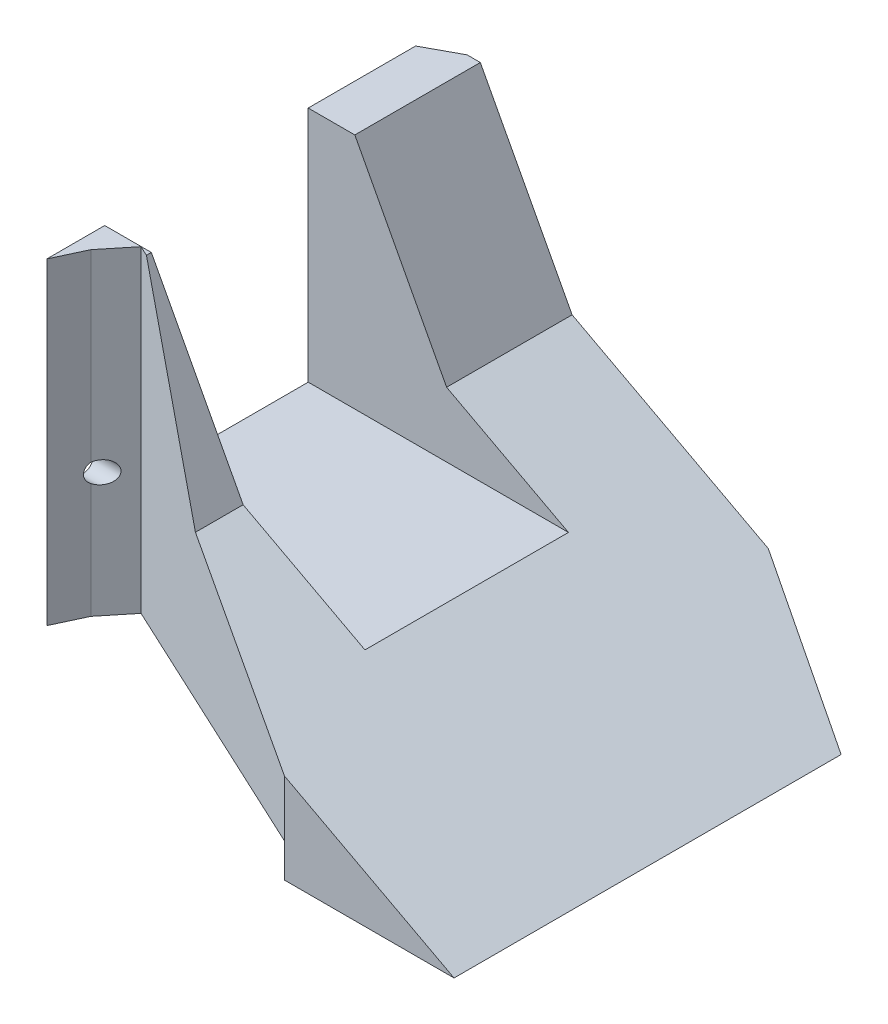
ISO-10303-21;
HEADER;
FILE_DESCRIPTION(('STEP AP214'),'2;1');
FILE_NAME('part.step','',(''),(''),'','','');
FILE_SCHEMA(('AUTOMOTIVE_DESIGN { 1 0 10303 214 1 1 1 1 }'));
ENDSEC;
DATA;
#1=APPLICATION_CONTEXT('core data for automotive mechanical design processes');
#2=APPLICATION_PROTOCOL_DEFINITION('international standard','automotive_design',2000,#1);
#3=PRODUCT_CONTEXT('',#1,'mechanical');
#4=PRODUCT('Part','Part','',(#3));
#5=PRODUCT_RELATED_PRODUCT_CATEGORY('part','',(#4));
#6=PRODUCT_DEFINITION_FORMATION('','',#4);
#7=PRODUCT_DEFINITION_CONTEXT('part definition',#1,'design');
#8=PRODUCT_DEFINITION('design','',#6,#7);
#9=PRODUCT_DEFINITION_SHAPE('','',#8);
#10=(LENGTH_UNIT() NAMED_UNIT(*) SI_UNIT(.MILLI.,.METRE.));
#11=(NAMED_UNIT(*) PLANE_ANGLE_UNIT() SI_UNIT($,.RADIAN.));
#12=(NAMED_UNIT(*) SI_UNIT($,.STERADIAN.) SOLID_ANGLE_UNIT());
#13=UNCERTAINTY_MEASURE_WITH_UNIT(LENGTH_MEASURE(1.E-05),#10,'distance_accuracy_value','');
#14=(GEOMETRIC_REPRESENTATION_CONTEXT(3) GLOBAL_UNCERTAINTY_ASSIGNED_CONTEXT((#13)) GLOBAL_UNIT_ASSIGNED_CONTEXT((#10,
#11,#12)) REPRESENTATION_CONTEXT('',''));
#15=CARTESIAN_POINT('',(0.,0.,0.));
#16=DIRECTION('',(0.,0.,1.));
#17=DIRECTION('',(1.,0.,0.));
#18=AXIS2_PLACEMENT_3D('',#15,#16,#17);
#19=CARTESIAN_POINT('',(70.,51.82,0.));
#20=DIRECTION('',(0.,-1.,0.));
#21=DIRECTION('',(0.,0.,-1.));
#22=AXIS2_PLACEMENT_3D('',#19,#20,#21);
#23=PLANE('',#22);
#24=DIRECTION('',(-1.,0.,0.));
#25=VECTOR('',#24,1.);
#26=CARTESIAN_POINT('',(70.,51.82,-67.));
#27=LINE('',#26,#25);
#28=CARTESIAN_POINT('',(6.87261250913682,51.82,-67.));
#29=VERTEX_POINT('',#28);
#30=CARTESIAN_POINT('',(4.92285614470007,51.82,-67.));
#31=VERTEX_POINT('',#30);
#32=EDGE_CURVE('E233',#29,#31,#27,.T.);
#33=ORIENTED_EDGE('',*,*,#32,.T.);
#34=DIRECTION('',(0.879381901521832,0.,-0.476117077278107));
#35=VECTOR('',#34,1.);
#36=CARTESIAN_POINT('',(4.92285614470007,51.82,-67.));
#37=LINE('',#36,#35);
#38=CARTESIAN_POINT('',(0.,51.82,-64.3346553125338));
#39=VERTEX_POINT('',#38);
#40=EDGE_CURVE('E287',#39,#31,#37,.T.);
#41=ORIENTED_EDGE('',*,*,#40,.F.);
#42=DIRECTION('',(0.,0.,1.));
#43=VECTOR('',#42,1.);
#44=CARTESIAN_POINT('',(0.,51.82,0.));
#45=LINE('',#44,#43);
#46=CARTESIAN_POINT('',(0.,51.82,-48.5));
#47=VERTEX_POINT('',#46);
#48=EDGE_CURVE('E234',#39,#47,#45,.T.);
#49=ORIENTED_EDGE('',*,*,#48,.T.);
#50=DIRECTION('',(-1.,0.,0.));
#51=VECTOR('',#50,1.);
#52=CARTESIAN_POINT('',(0.,51.82,-48.5));
#53=LINE('',#52,#51);
#54=CARTESIAN_POINT('',(6.87261250913682,51.82,-48.5));
#55=VERTEX_POINT('',#54);
#56=EDGE_CURVE('E197',#55,#47,#53,.T.);
#57=ORIENTED_EDGE('',*,*,#56,.F.);
#58=DIRECTION('',(0.,0.,1.));
#59=VECTOR('',#58,1.);
#60=CARTESIAN_POINT('',(6.87261250913682,51.82,-67.001));
#61=LINE('',#60,#59);
#62=EDGE_CURVE('E227',#29,#55,#61,.T.);
#63=ORIENTED_EDGE('',*,*,#62,.F.);
#64=EDGE_LOOP('',(#33,#41,#49,#57,#63));
#65=FACE_BOUND('',#64,.T.);
#66=ADVANCED_FACE('F33',(#65),#23,.F.);
#67=CARTESIAN_POINT('',(20.4043709815235,26.3704637183078,-67.001));
#68=DIRECTION('',(-0.882947592858928,-0.469471562785888,0.));
#69=DIRECTION('',(0.469471562785888,-0.882947592858928,0.));
#70=AXIS2_PLACEMENT_3D('',#67,#68,#69);
#71=PLANE('',#70);
#72=ORIENTED_EDGE('',*,*,#62,.T.);
#73=DIRECTION('',(0.469471562785888,-0.882947592858928,0.));
#74=VECTOR('',#73,1.);
#75=CARTESIAN_POINT('',(20.4043709815235,26.3704637183078,-48.5));
#76=LINE('',#75,#74);
#77=CARTESIAN_POINT('',(20.4043709815235,26.3704637183078,-48.5));
#78=VERTEX_POINT('',#77);
#79=EDGE_CURVE('E244',#55,#78,#76,.T.);
#80=ORIENTED_EDGE('',*,*,#79,.T.);
#81=DIRECTION('',(0.,0.,1.));
#82=VECTOR('',#81,1.);
#83=CARTESIAN_POINT('',(20.4043709815235,26.3704637183078,-67.001));
#84=LINE('',#83,#82);
#85=CARTESIAN_POINT('',(20.4043709815235,26.3704637183078,-67.));
#86=VERTEX_POINT('',#85);
#87=EDGE_CURVE('E222',#86,#78,#84,.T.);
#88=ORIENTED_EDGE('',*,*,#87,.F.);
#89=DIRECTION('',(-0.469471562785888,0.882947592858928,0.));
#90=VECTOR('',#89,1.);
#91=CARTESIAN_POINT('',(20.4043709815235,26.3704637183078,-67.));
#92=LINE('',#91,#90);
#93=EDGE_CURVE('E216',#86,#29,#92,.T.);
#94=ORIENTED_EDGE('',*,*,#93,.T.);
#95=EDGE_LOOP('',(#72,#80,#88,#94));
#96=FACE_BOUND('',#95,.T.);
#97=ADVANCED_FACE('F405',(#96),#71,.F.);
#98=CARTESIAN_POINT('',(70.,0.,0.));
#99=DIRECTION('',(0.,0.,-1.));
#100=DIRECTION('',(-1.,0.,0.));
#101=AXIS2_PLACEMENT_3D('',#98,#99,#100);
#102=PLANE('',#101);
#103=DIRECTION('',(0.882947592858926,-0.469471562785892,0.));
#104=VECTOR('',#103,1.);
#105=CARTESIAN_POINT('',(70.,0.,0.));
#106=LINE('',#105,#104);
#107=CARTESIAN_POINT('',(45.,13.292735791537,0.));
#108=VERTEX_POINT('',#107);
#109=CARTESIAN_POINT('',(70.,0.,0.));
#110=VERTEX_POINT('',#109);
#111=EDGE_CURVE('E219',#108,#110,#106,.T.);
#112=ORIENTED_EDGE('',*,*,#111,.F.);
#113=DIRECTION('',(0.,1.,0.));
#114=VECTOR('',#113,1.);
#115=CARTESIAN_POINT('',(45.,-0.001000000000001,0.));
#116=LINE('',#115,#114);
#117=CARTESIAN_POINT('',(45.,5.,0.));
#118=VERTEX_POINT('',#117);
#119=EDGE_CURVE('E294',#118,#108,#116,.T.);
#120=ORIENTED_EDGE('',*,*,#119,.F.);
#121=DIRECTION('',(0.,1.,0.));
#122=VECTOR('',#121,1.);
#123=CARTESIAN_POINT('',(45.,0.,0.));
#124=LINE('',#123,#122);
#125=CARTESIAN_POINT('',(45.,0.,0.));
#126=VERTEX_POINT('',#125);
#127=EDGE_CURVE('E179',#126,#118,#124,.T.);
#128=ORIENTED_EDGE('',*,*,#127,.F.);
#129=DIRECTION('',(-1.,0.,0.));
#130=VECTOR('',#129,1.);
#131=CARTESIAN_POINT('',(70.,0.,0.));
#132=LINE('',#131,#130);
#133=EDGE_CURVE('E238',#110,#126,#132,.T.);
#134=ORIENTED_EDGE('',*,*,#133,.F.);
#135=EDGE_LOOP('',(#112,#120,#128,#134));
#136=FACE_BOUND('',#135,.T.);
#137=ADVANCED_FACE('F35',(#136),#102,.F.);
#138=CARTESIAN_POINT('',(70.,0.,0.));
#139=DIRECTION('',(0.,1.,0.));
#140=DIRECTION('',(0.,0.,1.));
#141=AXIS2_PLACEMENT_3D('',#138,#139,#140);
#142=PLANE('',#141);
#143=DIRECTION('',(0.,0.,1.));
#144=VECTOR('',#143,1.);
#145=CARTESIAN_POINT('',(45.,0.,-67.001));
#146=LINE('',#145,#144);
#147=CARTESIAN_POINT('',(45.,0.,-66.4292587402506));
#148=VERTEX_POINT('',#147);
#149=EDGE_CURVE('E186',#148,#126,#146,.T.);
#150=ORIENTED_EDGE('',*,*,#149,.F.);
#151=DIRECTION('',(-0.936394113784694,0.,-0.350950229618641));
#152=VECTOR('',#151,1.);
#153=CARTESIAN_POINT('',(31.492463245744,0.,-71.4917351651914));
#154=LINE('',#153,#152);
#155=CARTESIAN_POINT('',(70.,0.,-57.0595333102129));
#156=VERTEX_POINT('',#155);
#157=EDGE_CURVE('E48',#156,#148,#154,.T.);
#158=ORIENTED_EDGE('',*,*,#157,.F.);
#159=DIRECTION('',(0.,0.,-1.));
#160=VECTOR('',#159,1.);
#161=CARTESIAN_POINT('',(70.,0.,0.));
#162=LINE('',#161,#160);
#163=EDGE_CURVE('E230',#110,#156,#162,.T.);
#164=ORIENTED_EDGE('',*,*,#163,.F.);
#165=ORIENTED_EDGE('',*,*,#133,.T.);
#166=EDGE_LOOP('',(#150,#158,#164,#165));
#167=FACE_BOUND('',#166,.T.);
#168=ADVANCED_FACE('F296',(#167),#142,.F.);
#169=CARTESIAN_POINT('',(70.,0.,-67.));
#170=DIRECTION('',(0.,0.,1.));
#171=DIRECTION('',(1.,0.,0.));
#172=AXIS2_PLACEMENT_3D('',#169,#170,#171);
#173=PLANE('',#172);
#174=DIRECTION('',(-0.882947592858926,0.469471562785892,0.));
#175=VECTOR('',#174,1.);
#176=CARTESIAN_POINT('',(70.,0.,-67.));
#177=LINE('',#176,#175);
#178=CARTESIAN_POINT('',(49.3228931364733,10.9942127388095,-67.));
#179=VERTEX_POINT('',#178);
#180=EDGE_CURVE('E169',#179,#86,#177,.T.);
#181=ORIENTED_EDGE('',*,*,#180,.F.);
#182=DIRECTION('',(0.469471562785892,0.882947592858926,0.));
#183=VECTOR('',#182,1.);
#184=CARTESIAN_POINT('',(33.8940098356148,-18.0232964158551,-67.));
#185=LINE('',#184,#183);
#186=CARTESIAN_POINT('',(45.,2.86403321018013,-67.));
#187=VERTEX_POINT('',#186);
#188=EDGE_CURVE('E154',#187,#179,#185,.T.);
#189=ORIENTED_EDGE('',*,*,#188,.F.);
#190=DIRECTION('',(0.,-1.,0.));
#191=VECTOR('',#190,1.);
#192=CARTESIAN_POINT('',(45.,0.,-67.));
#193=LINE('',#192,#191);
#194=CARTESIAN_POINT('',(45.,5.,-67.));
#195=VERTEX_POINT('',#194);
#196=EDGE_CURVE('E167',#195,#187,#193,.T.);
#197=ORIENTED_EDGE('',*,*,#196,.F.);
#198=DIRECTION('',(1.,0.,0.));
#199=VECTOR('',#198,1.);
#200=CARTESIAN_POINT('',(0.,5.,-67.));
#201=LINE('',#200,#199);
#202=CARTESIAN_POINT('',(4.92285614470006,5.,-67.));
#203=VERTEX_POINT('',#202);
#204=EDGE_CURVE('E176',#203,#195,#201,.T.);
#205=ORIENTED_EDGE('',*,*,#204,.F.);
#206=DIRECTION('',(0.,1.,0.));
#207=VECTOR('',#206,1.);
#208=CARTESIAN_POINT('',(4.92285614470007,-0.001000000000001,-67.));
#209=LINE('',#208,#207);
#210=EDGE_CURVE('E181',#203,#31,#209,.T.);
#211=ORIENTED_EDGE('',*,*,#210,.T.);
#212=ORIENTED_EDGE('',*,*,#32,.F.);
#213=ORIENTED_EDGE('',*,*,#93,.F.);
#214=EDGE_LOOP('',(#181,#189,#197,#205,#211,#212,#213));
#215=FACE_BOUND('',#214,.T.);
#216=ADVANCED_FACE('F165',(#215),#173,.F.);
#217=CARTESIAN_POINT('',(0.,51.82,-18.5));
#218=VERTEX_POINT('',#217);
#219=CARTESIAN_POINT('',(0.,51.82,-9.97625981893233));
#220=VERTEX_POINT('',#219);
#221=EDGE_CURVE('E225',#218,#220,#45,.T.);
#222=ORIENTED_EDGE('',*,*,#221,.T.);
#223=DIRECTION('',(-0.422618261740701,0.,0.906307787036649));
#224=VECTOR('',#223,1.);
#225=CARTESIAN_POINT('',(2.05934591289562,51.82,-14.39254138086));
#226=LINE('',#225,#224);
#227=CARTESIAN_POINT('',(2.05934591289562,51.82,-14.39254138086));
#228=VERTEX_POINT('',#227);
#229=EDGE_CURVE('E356',#228,#220,#226,.T.);
#230=ORIENTED_EDGE('',*,*,#229,.F.);
#231=DIRECTION('',(-0.630502689828236,0.,0.776187063870147));
#232=VECTOR('',#231,1.);
#233=CARTESIAN_POINT('',(5.37684298895508,51.82,-18.4765815545283));
#234=LINE('',#233,#232);
#235=CARTESIAN_POINT('',(5.37684298895508,51.82,-18.4765815545283));
#236=VERTEX_POINT('',#235);
#237=EDGE_CURVE('E353',#236,#228,#234,.T.);
#238=ORIENTED_EDGE('',*,*,#237,.F.);
#239=DIRECTION('',(-0.906307787036649,0.,-0.422618261740701));
#240=VECTOR('',#239,1.);
#241=CARTESIAN_POINT('',(45.,51.82,0.));
#242=LINE('',#241,#240);
#243=CARTESIAN_POINT('',(6.87261250913682,51.82,-17.7790927724327));
#244=VERTEX_POINT('',#243);
#245=EDGE_CURVE('E277',#244,#236,#242,.T.);
#246=ORIENTED_EDGE('',*,*,#245,.F.);
#247=CARTESIAN_POINT('',(6.87261250913682,51.82,-18.5));
#248=VERTEX_POINT('',#247);
#249=EDGE_CURVE('E221',#248,#244,#61,.T.);
#250=ORIENTED_EDGE('',*,*,#249,.F.);
#251=DIRECTION('',(1.,0.,0.));
#252=VECTOR('',#251,1.);
#253=CARTESIAN_POINT('',(0.,51.82,-18.5));
#254=LINE('',#253,#252);
#255=EDGE_CURVE('E190',#218,#248,#254,.T.);
#256=ORIENTED_EDGE('',*,*,#255,.F.);
#257=EDGE_LOOP('',(#222,#230,#238,#246,#250,#256));
#258=FACE_BOUND('',#257,.T.);
#259=ADVANCED_FACE('F271',(#258),#23,.F.);
#260=CARTESIAN_POINT('',(0.,0.,0.));
#261=DIRECTION('',(-1.,0.,0.));
#262=DIRECTION('',(0.,0.,1.));
#263=AXIS2_PLACEMENT_3D('',#260,#261,#262);
#264=PLANE('',#263);
#265=CARTESIAN_POINT('',(0.,23.32,-15.25));
#266=DIRECTION('',(-1.,0.,0.));
#267=DIRECTION('',(0.,0.,1.));
#268=AXIS2_PLACEMENT_3D('',#265,#266,#267);
#269=CIRCLE('',#268,1.6);
#270=CARTESIAN_POINT('',(0.,23.32,-13.65));
#271=VERTEX_POINT('',#270);
#272=EDGE_CURVE('E337',#271,#271,#269,.T.);
#273=ORIENTED_EDGE('',*,*,#272,.F.);
#274=EDGE_LOOP('',(#273));
#275=FACE_BOUND('',#274,.T.);
#276=CARTESIAN_POINT('',(0.,23.32,-52.25));
#277=DIRECTION('',(-1.,0.,0.));
#278=DIRECTION('',(0.,0.,1.));
#279=AXIS2_PLACEMENT_3D('',#276,#277,#278);
#280=CIRCLE('',#279,1.52209402722084);
#281=CARTESIAN_POINT('',(0.,23.32,-50.7279059727792));
#282=VERTEX_POINT('',#281);
#283=EDGE_CURVE('E334',#282,#282,#280,.T.);
#284=ORIENTED_EDGE('',*,*,#283,.F.);
#285=EDGE_LOOP('',(#284));
#286=FACE_BOUND('',#285,.T.);
#287=DIRECTION('',(0.,1.,0.));
#288=VECTOR('',#287,1.);
#289=CARTESIAN_POINT('',(0.,-0.001000000000001,-9.97625981893233));
#290=LINE('',#289,#288);
#291=CARTESIAN_POINT('',(0.,5.,-9.97625981893233));
#292=VERTEX_POINT('',#291);
#293=EDGE_CURVE('E358',#292,#220,#290,.T.);
#294=ORIENTED_EDGE('',*,*,#293,.T.);
#295=ORIENTED_EDGE('',*,*,#221,.F.);
#296=DIRECTION('',(0.,1.,0.));
#297=VECTOR('',#296,1.);
#298=CARTESIAN_POINT('',(0.,16.82,-18.5));
#299=LINE('',#298,#297);
#300=CARTESIAN_POINT('',(0.,16.82,-18.5));
#301=VERTEX_POINT('',#300);
#302=EDGE_CURVE('E202',#301,#218,#299,.T.);
#303=ORIENTED_EDGE('',*,*,#302,.F.);
#304=DIRECTION('',(0.,0.,1.));
#305=VECTOR('',#304,1.);
#306=CARTESIAN_POINT('',(0.,16.82,-18.5));
#307=LINE('',#306,#305);
#308=CARTESIAN_POINT('',(0.,16.82,-48.5));
#309=VERTEX_POINT('',#308);
#310=EDGE_CURVE('E193',#309,#301,#307,.T.);
#311=ORIENTED_EDGE('',*,*,#310,.F.);
#312=DIRECTION('',(0.,1.,0.));
#313=VECTOR('',#312,1.);
#314=CARTESIAN_POINT('',(0.,16.82,-48.5));
#315=LINE('',#314,#313);
#316=EDGE_CURVE('E206',#309,#47,#315,.T.);
#317=ORIENTED_EDGE('',*,*,#316,.T.);
#318=ORIENTED_EDGE('',*,*,#48,.F.);
#319=DIRECTION('',(0.,1.,0.));
#320=VECTOR('',#319,1.);
#321=CARTESIAN_POINT('',(0.,-0.001000000000001,-64.3346553125338));
#322=LINE('',#321,#320);
#323=CARTESIAN_POINT('',(0.,5.,-64.3346553125338));
#324=VERTEX_POINT('',#323);
#325=EDGE_CURVE('E369',#324,#39,#322,.T.);
#326=ORIENTED_EDGE('',*,*,#325,.F.);
#327=DIRECTION('',(0.,0.,1.));
#328=VECTOR('',#327,1.);
#329=CARTESIAN_POINT('',(0.,5.,-67.001));
#330=LINE('',#329,#328);
#331=EDGE_CURVE('E187',#324,#292,#330,.T.);
#332=ORIENTED_EDGE('',*,*,#331,.T.);
#333=EDGE_LOOP('',(#294,#295,#303,#311,#317,#318,#326,#332));
#334=FACE_BOUND('',#333,.T.);
#335=ADVANCED_FACE('F263',(#275,#286,#334),#264,.T.);
#336=CARTESIAN_POINT('',(70.,0.,-67.001));
#337=DIRECTION('',(-0.469471562785892,-0.882947592858927,0.));
#338=DIRECTION('',(0.882947592858926,-0.469471562785892,0.));
#339=AXIS2_PLACEMENT_3D('',#336,#337,#338);
#340=PLANE('',#339);
#341=ORIENTED_EDGE('',*,*,#163,.T.);
#342=DIRECTION('',(0.812757544570791,-0.432150852102315,0.390731128489274));
#343=VECTOR('',#342,1.);
#344=CARTESIAN_POINT('',(45.861553755469,12.8346395338708,-68.6640301298444));
#345=LINE('',#344,#343);
#346=EDGE_CURVE('E160',#179,#156,#345,.T.);
#347=ORIENTED_EDGE('',*,*,#346,.F.);
#348=ORIENTED_EDGE('',*,*,#180,.T.);
#349=ORIENTED_EDGE('',*,*,#87,.T.);
#350=DIRECTION('',(0.882947592858926,-0.469471562785892,0.));
#351=VECTOR('',#350,1.);
#352=CARTESIAN_POINT('',(70.,0.,-48.5));
#353=LINE('',#352,#351);
#354=CARTESIAN_POINT('',(38.3661808528748,16.82,-48.5));
#355=VERTEX_POINT('',#354);
#356=EDGE_CURVE('E213',#78,#355,#353,.T.);
#357=ORIENTED_EDGE('',*,*,#356,.T.);
#358=DIRECTION('',(0.,0.,1.));
#359=VECTOR('',#358,1.);
#360=CARTESIAN_POINT('',(38.3661808528748,16.82,-67.001));
#361=LINE('',#360,#359);
#362=CARTESIAN_POINT('',(38.3661808528748,16.82,-18.5));
#363=VERTEX_POINT('',#362);
#364=EDGE_CURVE('E41',#355,#363,#361,.T.);
#365=ORIENTED_EDGE('',*,*,#364,.T.);
#366=DIRECTION('',(-0.882947592858926,0.469471562785892,0.));
#367=VECTOR('',#366,1.);
#368=CARTESIAN_POINT('',(70.,0.,-18.5));
#369=LINE('',#368,#367);
#370=CARTESIAN_POINT('',(20.4043709815235,26.3704637183078,-18.5));
#371=VERTEX_POINT('',#370);
#372=EDGE_CURVE('E209',#363,#371,#369,.T.);
#373=ORIENTED_EDGE('',*,*,#372,.T.);
#374=CARTESIAN_POINT('',(20.4043709815235,26.3704637183078,-11.469130168455));
#375=VERTEX_POINT('',#374);
#376=EDGE_CURVE('E226',#371,#375,#84,.T.);
#377=ORIENTED_EDGE('',*,*,#376,.T.);
#378=DIRECTION('',(-0.816453649719837,0.434116106070476,-0.38071858939296));
#379=VECTOR('',#378,1.);
#380=CARTESIAN_POINT('',(49.711774274424,10.7874409699658,2.19713642766164));
#381=LINE('',#380,#379);
#382=EDGE_CURVE('E283',#108,#375,#381,.T.);
#383=ORIENTED_EDGE('',*,*,#382,.F.);
#384=ORIENTED_EDGE('',*,*,#111,.T.);
#385=EDGE_LOOP('',(#341,#347,#348,#349,#357,#365,#373,#377,#383,#384));
#386=FACE_BOUND('',#385,.T.);
#387=ADVANCED_FACE('F248',(#386),#340,.F.);
#388=ORIENTED_EDGE('',*,*,#249,.T.);
#389=DIRECTION('',(-0.45861066994838,0.862521224262135,-0.213853667508525));
#390=VECTOR('',#389,1.);
#391=CARTESIAN_POINT('',(37.1337914189756,-5.09300004831444,-3.66807330197626));
#392=LINE('',#391,#390);
#393=EDGE_CURVE('E281',#375,#244,#392,.T.);
#394=ORIENTED_EDGE('',*,*,#393,.F.);
#395=ORIENTED_EDGE('',*,*,#376,.F.);
#396=DIRECTION('',(-0.469471562785888,0.882947592858928,0.));
#397=VECTOR('',#396,1.);
#398=CARTESIAN_POINT('',(20.4043709815235,26.3704637183078,-18.5));
#399=LINE('',#398,#397);
#400=EDGE_CURVE('E241',#371,#248,#399,.T.);
#401=ORIENTED_EDGE('',*,*,#400,.T.);
#402=EDGE_LOOP('',(#388,#394,#395,#401));
#403=FACE_BOUND('',#402,.T.);
#404=ADVANCED_FACE('F280',(#403),#71,.F.);
#405=CARTESIAN_POINT('',(0.,16.82,0.));
#406=DIRECTION('',(0.,-1.,0.));
#407=DIRECTION('',(0.,0.,-1.));
#408=AXIS2_PLACEMENT_3D('',#405,#406,#407);
#409=PLANE('',#408);
#410=DIRECTION('',(-1.,0.,0.));
#411=VECTOR('',#410,1.);
#412=CARTESIAN_POINT('',(0.,16.82,-48.5));
#413=LINE('',#412,#411);
#414=EDGE_CURVE('E200',#355,#309,#413,.T.);
#415=ORIENTED_EDGE('',*,*,#414,.T.);
#416=ORIENTED_EDGE('',*,*,#310,.T.);
#417=DIRECTION('',(1.,0.,0.));
#418=VECTOR('',#417,1.);
#419=CARTESIAN_POINT('',(0.,16.82,-18.5));
#420=LINE('',#419,#418);
#421=EDGE_CURVE('E196',#301,#363,#420,.T.);
#422=ORIENTED_EDGE('',*,*,#421,.T.);
#423=ORIENTED_EDGE('',*,*,#364,.F.);
#424=EDGE_LOOP('',(#415,#416,#422,#423));
#425=FACE_BOUND('',#424,.T.);
#426=ADVANCED_FACE('F253',(#425),#409,.F.);
#427=CARTESIAN_POINT('',(0.,16.82,-48.5));
#428=DIRECTION('',(0.,0.,-1.));
#429=DIRECTION('',(-1.,0.,0.));
#430=AXIS2_PLACEMENT_3D('',#427,#428,#429);
#431=PLANE('',#430);
#432=ORIENTED_EDGE('',*,*,#79,.F.);
#433=ORIENTED_EDGE('',*,*,#56,.T.);
#434=ORIENTED_EDGE('',*,*,#316,.F.);
#435=ORIENTED_EDGE('',*,*,#414,.F.);
#436=ORIENTED_EDGE('',*,*,#356,.F.);
#437=EDGE_LOOP('',(#432,#433,#434,#435,#436));
#438=FACE_BOUND('',#437,.T.);
#439=ADVANCED_FACE('F256',(#438),#431,.F.);
#440=CARTESIAN_POINT('',(0.,16.82,-18.5));
#441=DIRECTION('',(0.,0.,1.));
#442=DIRECTION('',(1.,0.,0.));
#443=AXIS2_PLACEMENT_3D('',#440,#441,#442);
#444=PLANE('',#443);
#445=ORIENTED_EDGE('',*,*,#421,.F.);
#446=ORIENTED_EDGE('',*,*,#302,.T.);
#447=ORIENTED_EDGE('',*,*,#255,.T.);
#448=ORIENTED_EDGE('',*,*,#400,.F.);
#449=ORIENTED_EDGE('',*,*,#372,.F.);
#450=EDGE_LOOP('',(#445,#446,#447,#448,#449));
#451=FACE_BOUND('',#450,.T.);
#452=ADVANCED_FACE('F268',(#451),#444,.F.);
#453=CARTESIAN_POINT('',(0.,5.,-67.001));
#454=DIRECTION('',(0.,1.,0.));
#455=DIRECTION('',(0.,0.,1.));
#456=AXIS2_PLACEMENT_3D('',#453,#454,#455);
#457=PLANE('',#456);
#458=CARTESIAN_POINT('',(35.,5.,-13.));
#459=DIRECTION('',(0.,-1.,0.));
#460=DIRECTION('',(0.,0.,-1.));
#461=AXIS2_PLACEMENT_3D('',#458,#459,#460);
#462=CIRCLE('',#461,1.75);
#463=CARTESIAN_POINT('',(35.,5.,-14.75));
#464=VERTEX_POINT('',#463);
#465=EDGE_CURVE('E159',#464,#464,#462,.T.);
#466=ORIENTED_EDGE('',*,*,#465,.F.);
#467=EDGE_LOOP('',(#466));
#468=FACE_BOUND('',#467,.T.);
#469=CARTESIAN_POINT('',(10.,5.,-58.));
#470=DIRECTION('',(0.,-1.,0.));
#471=DIRECTION('',(0.,0.,-1.));
#472=AXIS2_PLACEMENT_3D('',#469,#470,#471);
#473=CIRCLE('',#472,1.75);
#474=CARTESIAN_POINT('',(10.,5.,-59.75));
#475=VERTEX_POINT('',#474);
#476=EDGE_CURVE('E319',#475,#475,#473,.T.);
#477=ORIENTED_EDGE('',*,*,#476,.F.);
#478=EDGE_LOOP('',(#477));
#479=FACE_BOUND('',#478,.T.);
#480=CARTESIAN_POINT('',(10.,5.,-38.));
#481=DIRECTION('',(0.,-1.,0.));
#482=DIRECTION('',(0.,0.,-1.));
#483=AXIS2_PLACEMENT_3D('',#480,#481,#482);
#484=CIRCLE('',#483,1.75);
#485=CARTESIAN_POINT('',(10.,5.,-39.75));
#486=VERTEX_POINT('',#485);
#487=EDGE_CURVE('E304',#486,#486,#484,.T.);
#488=ORIENTED_EDGE('',*,*,#487,.F.);
#489=EDGE_LOOP('',(#488));
#490=FACE_BOUND('',#489,.T.);
#491=CARTESIAN_POINT('',(35.,5.,-38.));
#492=DIRECTION('',(0.,-1.,0.));
#493=DIRECTION('',(0.,0.,-1.));
#494=AXIS2_PLACEMENT_3D('',#491,#492,#493);
#495=CIRCLE('',#494,1.75);
#496=CARTESIAN_POINT('',(35.,5.,-39.75));
#497=VERTEX_POINT('',#496);
#498=EDGE_CURVE('E305',#497,#497,#495,.T.);
#499=ORIENTED_EDGE('',*,*,#498,.F.);
#500=EDGE_LOOP('',(#499));
#501=FACE_BOUND('',#500,.T.);
#502=CARTESIAN_POINT('',(10.,5.,-19.3013740496408));
#503=DIRECTION('',(0.,-1.,0.));
#504=DIRECTION('',(0.,0.,-1.));
#505=AXIS2_PLACEMENT_3D('',#502,#503,#504);
#506=CIRCLE('',#505,1.75);
#507=CARTESIAN_POINT('',(10.,5.,-21.0513740496408));
#508=VERTEX_POINT('',#507);
#509=EDGE_CURVE('E311',#508,#508,#506,.T.);
#510=ORIENTED_EDGE('',*,*,#509,.F.);
#511=EDGE_LOOP('',(#510));
#512=FACE_BOUND('',#511,.T.);
#513=CARTESIAN_POINT('',(35.,5.,-58.));
#514=DIRECTION('',(0.,-1.,0.));
#515=DIRECTION('',(0.,0.,-1.));
#516=AXIS2_PLACEMENT_3D('',#513,#514,#515);
#517=CIRCLE('',#516,1.75);
#518=CARTESIAN_POINT('',(35.,5.,-59.75));
#519=VERTEX_POINT('',#518);
#520=EDGE_CURVE('E318',#519,#519,#517,.T.);
#521=ORIENTED_EDGE('',*,*,#520,.F.);
#522=EDGE_LOOP('',(#521));
#523=FACE_BOUND('',#522,.T.);
#524=DIRECTION('',(0.630502689828236,0.,-0.776187063870147));
#525=VECTOR('',#524,1.);
#526=CARTESIAN_POINT('',(5.37684298895508,5.,-18.4765815545283));
#527=LINE('',#526,#525);
#528=CARTESIAN_POINT('',(2.05934591289562,5.,-14.39254138086));
#529=VERTEX_POINT('',#528);
#530=CARTESIAN_POINT('',(5.37684298895508,5.,-18.4765815545283));
#531=VERTEX_POINT('',#530);
#532=EDGE_CURVE('E347',#529,#531,#527,.T.);
#533=ORIENTED_EDGE('',*,*,#532,.F.);
#534=DIRECTION('',(0.422618261740701,0.,-0.906307787036649));
#535=VECTOR('',#534,1.);
#536=CARTESIAN_POINT('',(2.05934591289562,5.,-14.39254138086));
#537=LINE('',#536,#535);
#538=EDGE_CURVE('E349',#292,#529,#537,.T.);
#539=ORIENTED_EDGE('',*,*,#538,.F.);
#540=ORIENTED_EDGE('',*,*,#331,.F.);
#541=DIRECTION('',(-0.879381901521832,0.,0.476117077278107));
#542=VECTOR('',#541,1.);
#543=CARTESIAN_POINT('',(4.92285614470007,5.,-67.));
#544=LINE('',#543,#542);
#545=EDGE_CURVE('E177',#203,#324,#544,.T.);
#546=ORIENTED_EDGE('',*,*,#545,.F.);
#547=ORIENTED_EDGE('',*,*,#204,.T.);
#548=DIRECTION('',(0.,0.,1.));
#549=VECTOR('',#548,1.);
#550=CARTESIAN_POINT('',(45.,5.,-67.001));
#551=LINE('',#550,#549);
#552=EDGE_CURVE('E175',#195,#118,#551,.T.);
#553=ORIENTED_EDGE('',*,*,#552,.T.);
#554=DIRECTION('',(0.906307787036649,0.,0.422618261740701));
#555=VECTOR('',#554,1.);
#556=CARTESIAN_POINT('',(45.,5.,0.));
#557=LINE('',#556,#555);
#558=EDGE_CURVE('E288',#531,#118,#557,.T.);
#559=ORIENTED_EDGE('',*,*,#558,.F.);
#560=EDGE_LOOP('',(#533,#539,#540,#546,#547,#553,#559));
#561=FACE_BOUND('',#560,.T.);
#562=ADVANCED_FACE('F382',(#468,#479,#490,#501,#512,#523,#561),#457,.F.);
#563=CARTESIAN_POINT('',(45.,0.,-67.001));
#564=DIRECTION('',(1.,0.,0.));
#565=DIRECTION('',(0.,0.,-1.));
#566=AXIS2_PLACEMENT_3D('',#563,#564,#565);
#567=PLANE('',#566);
#568=ORIENTED_EDGE('',*,*,#196,.T.);
#569=DIRECTION('',(0.,0.980716447278817,-0.195436051016221));
#570=VECTOR('',#569,1.);
#571=CARTESIAN_POINT('',(45.,-15.136428160058,-63.4128886627419));
#572=LINE('',#571,#570);
#573=EDGE_CURVE('E151',#148,#187,#572,.T.);
#574=ORIENTED_EDGE('',*,*,#573,.F.);
#575=ORIENTED_EDGE('',*,*,#149,.T.);
#576=ORIENTED_EDGE('',*,*,#127,.T.);
#577=ORIENTED_EDGE('',*,*,#552,.F.);
#578=EDGE_LOOP('',(#568,#574,#575,#576,#577));
#579=FACE_BOUND('',#578,.T.);
#580=ADVANCED_FACE('F172',(#579),#567,.F.);
#581=CARTESIAN_POINT('',(4.92285614470007,-0.001000000000001,-67.));
#582=DIRECTION('',(0.476117077278107,0.,0.879381901521832));
#583=DIRECTION('',(0.879381901521832,0.,-0.476117077278107));
#584=AXIS2_PLACEMENT_3D('',#581,#582,#583);
#585=PLANE('',#584);
#586=ORIENTED_EDGE('',*,*,#545,.T.);
#587=ORIENTED_EDGE('',*,*,#325,.T.);
#588=ORIENTED_EDGE('',*,*,#40,.T.);
#589=ORIENTED_EDGE('',*,*,#210,.F.);
#590=EDGE_LOOP('',(#586,#587,#588,#589));
#591=FACE_BOUND('',#590,.T.);
#592=ADVANCED_FACE('F374',(#591),#585,.F.);
#593=CARTESIAN_POINT('',(2.05934591289562,-0.001000000000001,-14.39254138086));
#594=DIRECTION('',(-0.906307787036649,0.,-0.422618261740701));
#595=DIRECTION('',(-0.422618261740701,0.,0.906307787036649));
#596=AXIS2_PLACEMENT_3D('',#593,#594,#595);
#597=PLANE('',#596);
#598=DIRECTION('',(0.,1.,0.));
#599=VECTOR('',#598,1.);
#600=CARTESIAN_POINT('',(2.05934591289562,-0.001000000000001,-14.39254138086));
#601=LINE('',#600,#599);
#602=CARTESIAN_POINT('',(2.05934591289562,21.9691614765404,-14.39254138086));
#603=VERTEX_POINT('',#602);
#604=EDGE_CURVE('E360',#529,#603,#601,.T.);
#605=ORIENTED_EDGE('',*,*,#604,.T.);
#606=CARTESIAN_POINT('',(2.4591854335516,23.32,-15.25));
#607=DIRECTION('',(-0.906307787036649,0.,-0.422618261740701));
#608=DIRECTION('',(-0.422618261740701,0.,0.906307787036649));
#609=AXIS2_PLACEMENT_3D('',#606,#607,#608);
#610=ELLIPSE('',#609,1.76540467033999,1.6);
#611=CARTESIAN_POINT('',(2.05934591289562,24.6708385234596,-14.39254138086));
#612=VERTEX_POINT('',#611);
#613=EDGE_CURVE('E55',#603,#612,#610,.T.);
#614=ORIENTED_EDGE('',*,*,#613,.T.);
#615=EDGE_CURVE('E363',#612,#228,#601,.T.);
#616=ORIENTED_EDGE('',*,*,#615,.T.);
#617=ORIENTED_EDGE('',*,*,#229,.T.);
#618=ORIENTED_EDGE('',*,*,#293,.F.);
#619=ORIENTED_EDGE('',*,*,#538,.T.);
#620=EDGE_LOOP('',(#605,#614,#616,#617,#618,#619));
#621=FACE_BOUND('',#620,.T.);
#622=ADVANCED_FACE('F385',(#621),#597,.F.);
#623=CARTESIAN_POINT('',(5.37684298895508,-0.001000000000001,-18.4765815545283));
#624=DIRECTION('',(-0.776187063870147,0.,-0.630502689828236));
#625=DIRECTION('',(-0.630502689828236,0.,0.776187063870147));
#626=AXIS2_PLACEMENT_3D('',#623,#624,#625);
#627=PLANE('',#626);
#628=ORIENTED_EDGE('',*,*,#615,.F.);
#629=CARTESIAN_POINT('',(2.75586610879856,23.32,-15.25));
#630=DIRECTION('',(-0.776187063870147,0.,-0.630502689828236));
#631=DIRECTION('',(-0.630502689828236,0.,0.776187063870147));
#632=AXIS2_PLACEMENT_3D('',#629,#630,#631);
#633=ELLIPSE('',#632,2.06135875548124,1.6);
#634=EDGE_CURVE('E11',#612,#603,#633,.T.);
#635=ORIENTED_EDGE('',*,*,#634,.T.);
#636=ORIENTED_EDGE('',*,*,#604,.F.);
#637=ORIENTED_EDGE('',*,*,#532,.T.);
#638=DIRECTION('',(0.,1.,0.));
#639=VECTOR('',#638,1.);
#640=CARTESIAN_POINT('',(5.37684298895508,-0.001000000000001,-18.4765815545283));
#641=LINE('',#640,#639);
#642=EDGE_CURVE('E364',#531,#236,#641,.T.);
#643=ORIENTED_EDGE('',*,*,#642,.T.);
#644=ORIENTED_EDGE('',*,*,#237,.T.);
#645=EDGE_LOOP('',(#628,#635,#636,#637,#643,#644));
#646=FACE_BOUND('',#645,.T.);
#647=ADVANCED_FACE('F388',(#646),#627,.F.);
#648=CARTESIAN_POINT('',(45.,-0.001000000000001,0.));
#649=DIRECTION('',(0.422618261740701,0.,-0.906307787036649));
#650=DIRECTION('',(-0.906307787036649,0.,-0.422618261740701));
#651=AXIS2_PLACEMENT_3D('',#648,#649,#650);
#652=PLANE('',#651);
#653=ORIENTED_EDGE('',*,*,#382,.T.);
#654=ORIENTED_EDGE('',*,*,#393,.T.);
#655=ORIENTED_EDGE('',*,*,#245,.T.);
#656=ORIENTED_EDGE('',*,*,#642,.F.);
#657=ORIENTED_EDGE('',*,*,#558,.T.);
#658=ORIENTED_EDGE('',*,*,#119,.T.);
#659=EDGE_LOOP('',(#653,#654,#655,#656,#657,#658));
#660=FACE_BOUND('',#659,.T.);
#661=ADVANCED_FACE('F391',(#660),#652,.F.);
#662=CARTESIAN_POINT('',(6.,23.32,-15.25));
#663=DIRECTION('',(-1.,0.,0.));
#664=DIRECTION('',(0.,0.,1.));
#665=AXIS2_PLACEMENT_3D('',#662,#663,#664);
#666=CYLINDRICAL_SURFACE('',#665,1.6);
#667=ORIENTED_EDGE('',*,*,#272,.T.);
#668=EDGE_LOOP('',(#667));
#669=FACE_BOUND('',#668,.T.);
#670=ORIENTED_EDGE('',*,*,#634,.F.);
#671=ORIENTED_EDGE('',*,*,#613,.F.);
#672=EDGE_LOOP('',(#670,#671));
#673=FACE_BOUND('',#672,.T.);
#674=ADVANCED_FACE('F393',(#669,#673),#666,.F.);
#675=CARTESIAN_POINT('',(6.,23.32,-52.25));
#676=DIRECTION('',(-1.,0.,0.));
#677=DIRECTION('',(0.,0.,1.));
#678=AXIS2_PLACEMENT_3D('',#675,#676,#677);
#679=CYLINDRICAL_SURFACE('',#678,1.52209402722084);
#680=CARTESIAN_POINT('',(6.,23.32,-52.25));
#681=DIRECTION('',(-1.,0.,0.));
#682=DIRECTION('',(0.,0.,1.));
#683=AXIS2_PLACEMENT_3D('',#680,#681,#682);
#684=CIRCLE('',#683,1.52209402722084);
#685=CARTESIAN_POINT('',(6.,23.32,-50.7279059727792));
#686=VERTEX_POINT('',#685);
#687=EDGE_CURVE('E340',#686,#686,#684,.T.);
#688=ORIENTED_EDGE('',*,*,#687,.F.);
#689=EDGE_LOOP('',(#688));
#690=FACE_BOUND('',#689,.T.);
#691=ORIENTED_EDGE('',*,*,#283,.T.);
#692=EDGE_LOOP('',(#691));
#693=FACE_BOUND('',#692,.T.);
#694=ADVANCED_FACE('F399',(#690,#693),#679,.F.);
#695=CARTESIAN_POINT('',(6.,23.32,-52.25));
#696=DIRECTION('',(-1.,0.,0.));
#697=DIRECTION('',(0.,0.,1.));
#698=AXIS2_PLACEMENT_3D('',#695,#696,#697);
#699=PLANE('',#698);
#700=ORIENTED_EDGE('',*,*,#687,.T.);
#701=EDGE_LOOP('',(#700));
#702=FACE_BOUND('',#701,.T.);
#703=ADVANCED_FACE('F504',(#702),#699,.T.);
#704=CARTESIAN_POINT('',(35.,11.,-58.));
#705=DIRECTION('',(0.,-1.,0.));
#706=DIRECTION('',(0.,0.,-1.));
#707=AXIS2_PLACEMENT_3D('',#704,#705,#706);
#708=CYLINDRICAL_SURFACE('',#707,1.75);
#709=CARTESIAN_POINT('',(35.,11.,-58.));
#710=DIRECTION('',(0.,-1.,0.));
#711=DIRECTION('',(0.,0.,-1.));
#712=AXIS2_PLACEMENT_3D('',#709,#710,#711);
#713=CIRCLE('',#712,1.75);
#714=CARTESIAN_POINT('',(35.,11.,-59.75));
#715=VERTEX_POINT('',#714);
#716=EDGE_CURVE('E331',#715,#715,#713,.T.);
#717=ORIENTED_EDGE('',*,*,#716,.F.);
#718=EDGE_LOOP('',(#717));
#719=FACE_BOUND('',#718,.T.);
#720=ORIENTED_EDGE('',*,*,#520,.T.);
#721=EDGE_LOOP('',(#720));
#722=FACE_BOUND('',#721,.T.);
#723=ADVANCED_FACE('F514',(#719,#722),#708,.F.);
#724=CARTESIAN_POINT('',(35.,11.,-58.));
#725=DIRECTION('',(0.,-1.,0.));
#726=DIRECTION('',(0.,0.,-1.));
#727=AXIS2_PLACEMENT_3D('',#724,#725,#726);
#728=PLANE('',#727);
#729=ORIENTED_EDGE('',*,*,#716,.T.);
#730=EDGE_LOOP('',(#729));
#731=FACE_BOUND('',#730,.T.);
#732=ADVANCED_FACE('F531',(#731),#728,.T.);
#733=CARTESIAN_POINT('',(10.,11.,-19.3013740496408));
#734=DIRECTION('',(0.,-1.,0.));
#735=DIRECTION('',(0.,0.,-1.));
#736=AXIS2_PLACEMENT_3D('',#733,#734,#735);
#737=CYLINDRICAL_SURFACE('',#736,1.75);
#738=CARTESIAN_POINT('',(10.,11.,-19.3013740496408));
#739=DIRECTION('',(0.,-1.,0.));
#740=DIRECTION('',(0.,0.,-1.));
#741=AXIS2_PLACEMENT_3D('',#738,#739,#740);
#742=CIRCLE('',#741,1.75);
#743=CARTESIAN_POINT('',(10.,11.,-21.0513740496408));
#744=VERTEX_POINT('',#743);
#745=EDGE_CURVE('E308',#744,#744,#742,.T.);
#746=ORIENTED_EDGE('',*,*,#745,.F.);
#747=EDGE_LOOP('',(#746));
#748=FACE_BOUND('',#747,.T.);
#749=ORIENTED_EDGE('',*,*,#509,.T.);
#750=EDGE_LOOP('',(#749));
#751=FACE_BOUND('',#750,.T.);
#752=ADVANCED_FACE('F541',(#748,#751),#737,.F.);
#753=CARTESIAN_POINT('',(10.,11.,-19.3013740496408));
#754=DIRECTION('',(0.,-1.,0.));
#755=DIRECTION('',(0.,0.,-1.));
#756=AXIS2_PLACEMENT_3D('',#753,#754,#755);
#757=PLANE('',#756);
#758=ORIENTED_EDGE('',*,*,#745,.T.);
#759=EDGE_LOOP('',(#758));
#760=FACE_BOUND('',#759,.T.);
#761=ADVANCED_FACE('F551',(#760),#757,.T.);
#762=CARTESIAN_POINT('',(35.,11.,-38.));
#763=DIRECTION('',(0.,-1.,0.));
#764=DIRECTION('',(0.,0.,-1.));
#765=AXIS2_PLACEMENT_3D('',#762,#763,#764);
#766=CYLINDRICAL_SURFACE('',#765,1.75);
#767=CARTESIAN_POINT('',(35.,11.,-38.));
#768=DIRECTION('',(0.,-1.,0.));
#769=DIRECTION('',(0.,0.,-1.));
#770=AXIS2_PLACEMENT_3D('',#767,#768,#769);
#771=CIRCLE('',#770,1.75);
#772=CARTESIAN_POINT('',(35.,11.,-39.75));
#773=VERTEX_POINT('',#772);
#774=EDGE_CURVE('E301',#773,#773,#771,.T.);
#775=ORIENTED_EDGE('',*,*,#774,.F.);
#776=EDGE_LOOP('',(#775));
#777=FACE_BOUND('',#776,.T.);
#778=ORIENTED_EDGE('',*,*,#498,.T.);
#779=EDGE_LOOP('',(#778));
#780=FACE_BOUND('',#779,.T.);
#781=ADVANCED_FACE('F561',(#777,#780),#766,.F.);
#782=CARTESIAN_POINT('',(35.,11.,-38.));
#783=DIRECTION('',(0.,-1.,0.));
#784=DIRECTION('',(0.,0.,-1.));
#785=AXIS2_PLACEMENT_3D('',#782,#783,#784);
#786=PLANE('',#785);
#787=ORIENTED_EDGE('',*,*,#774,.T.);
#788=EDGE_LOOP('',(#787));
#789=FACE_BOUND('',#788,.T.);
#790=ADVANCED_FACE('F571',(#789),#786,.T.);
#791=CARTESIAN_POINT('',(10.,11.,-38.));
#792=DIRECTION('',(0.,-1.,0.));
#793=DIRECTION('',(0.,0.,-1.));
#794=AXIS2_PLACEMENT_3D('',#791,#792,#793);
#795=CYLINDRICAL_SURFACE('',#794,1.75);
#796=CARTESIAN_POINT('',(10.,11.,-38.));
#797=DIRECTION('',(0.,-1.,0.));
#798=DIRECTION('',(0.,0.,-1.));
#799=AXIS2_PLACEMENT_3D('',#796,#797,#798);
#800=CIRCLE('',#799,1.75);
#801=CARTESIAN_POINT('',(10.,11.,-39.75));
#802=VERTEX_POINT('',#801);
#803=EDGE_CURVE('E322',#802,#802,#800,.T.);
#804=ORIENTED_EDGE('',*,*,#803,.F.);
#805=EDGE_LOOP('',(#804));
#806=FACE_BOUND('',#805,.T.);
#807=ORIENTED_EDGE('',*,*,#487,.T.);
#808=EDGE_LOOP('',(#807));
#809=FACE_BOUND('',#808,.T.);
#810=ADVANCED_FACE('F581',(#806,#809),#795,.F.);
#811=CARTESIAN_POINT('',(10.,11.,-38.));
#812=DIRECTION('',(0.,-1.,0.));
#813=DIRECTION('',(0.,0.,-1.));
#814=AXIS2_PLACEMENT_3D('',#811,#812,#813);
#815=PLANE('',#814);
#816=ORIENTED_EDGE('',*,*,#803,.T.);
#817=EDGE_LOOP('',(#816));
#818=FACE_BOUND('',#817,.T.);
#819=ADVANCED_FACE('F591',(#818),#815,.T.);
#820=CARTESIAN_POINT('',(10.,11.,-58.));
#821=DIRECTION('',(0.,-1.,0.));
#822=DIRECTION('',(0.,0.,-1.));
#823=AXIS2_PLACEMENT_3D('',#820,#821,#822);
#824=CYLINDRICAL_SURFACE('',#823,1.75);
#825=CARTESIAN_POINT('',(10.,11.,-58.));
#826=DIRECTION('',(0.,-1.,0.));
#827=DIRECTION('',(0.,0.,-1.));
#828=AXIS2_PLACEMENT_3D('',#825,#826,#827);
#829=CIRCLE('',#828,1.75);
#830=CARTESIAN_POINT('',(10.,11.,-59.75));
#831=VERTEX_POINT('',#830);
#832=EDGE_CURVE('E315',#831,#831,#829,.T.);
#833=ORIENTED_EDGE('',*,*,#832,.F.);
#834=EDGE_LOOP('',(#833));
#835=FACE_BOUND('',#834,.T.);
#836=ORIENTED_EDGE('',*,*,#476,.T.);
#837=EDGE_LOOP('',(#836));
#838=FACE_BOUND('',#837,.T.);
#839=ADVANCED_FACE('F601',(#835,#838),#824,.F.);
#840=CARTESIAN_POINT('',(10.,11.,-58.));
#841=DIRECTION('',(0.,-1.,0.));
#842=DIRECTION('',(0.,0.,-1.));
#843=AXIS2_PLACEMENT_3D('',#840,#841,#842);
#844=PLANE('',#843);
#845=ORIENTED_EDGE('',*,*,#832,.T.);
#846=EDGE_LOOP('',(#845));
#847=FACE_BOUND('',#846,.T.);
#848=ADVANCED_FACE('F611',(#847),#844,.T.);
#849=CARTESIAN_POINT('',(35.,11.,-13.));
#850=DIRECTION('',(0.,-1.,0.));
#851=DIRECTION('',(0.,0.,-1.));
#852=AXIS2_PLACEMENT_3D('',#849,#850,#851);
#853=CYLINDRICAL_SURFACE('',#852,1.75);
#854=CARTESIAN_POINT('',(35.,11.,-13.));
#855=DIRECTION('',(0.,-1.,0.));
#856=DIRECTION('',(0.,0.,-1.));
#857=AXIS2_PLACEMENT_3D('',#854,#855,#856);
#858=CIRCLE('',#857,1.75);
#859=CARTESIAN_POINT('',(35.,11.,-14.75));
#860=VERTEX_POINT('',#859);
#861=EDGE_CURVE('E314',#860,#860,#858,.T.);
#862=ORIENTED_EDGE('',*,*,#861,.F.);
#863=EDGE_LOOP('',(#862));
#864=FACE_BOUND('',#863,.T.);
#865=ORIENTED_EDGE('',*,*,#465,.T.);
#866=EDGE_LOOP('',(#865));
#867=FACE_BOUND('',#866,.T.);
#868=ADVANCED_FACE('F621',(#864,#867),#853,.F.);
#869=CARTESIAN_POINT('',(35.,11.,-13.));
#870=DIRECTION('',(0.,-1.,0.));
#871=DIRECTION('',(0.,0.,-1.));
#872=AXIS2_PLACEMENT_3D('',#869,#870,#871);
#873=PLANE('',#872);
#874=ORIENTED_EDGE('',*,*,#861,.T.);
#875=EDGE_LOOP('',(#874));
#876=FACE_BOUND('',#875,.T.);
#877=ADVANCED_FACE('F631',(#876),#873,.T.);
#878=CARTESIAN_POINT('',(30.4326704546105,-16.1828696207938,-68.6640301298444));
#879=DIRECTION('',(-0.344995109354657,0.183437153520955,0.92050485345244));
#880=DIRECTION('',(0.936394113784694,0.,0.350950229618641));
#881=AXIS2_PLACEMENT_3D('',#878,#879,#880);
#882=PLANE('',#881);
#883=ORIENTED_EDGE('',*,*,#157,.T.);
#884=ORIENTED_EDGE('',*,*,#573,.T.);
#885=ORIENTED_EDGE('',*,*,#188,.T.);
#886=ORIENTED_EDGE('',*,*,#346,.T.);
#887=EDGE_LOOP('',(#883,#884,#885,#886));
#888=FACE_BOUND('',#887,.T.);
#889=ADVANCED_FACE('F153',(#888),#882,.F.);
#890=CLOSED_SHELL('',(#66,#97,#137,#168,#216,#259,#335,#387,#404,#426,#439,#452,#562,#580,#592,
#622,#647,#661,#674,#694,#703,#723,#732,#752,#761,#781,#790,#810,#819,#839,#848,#868,#877,#889));
#891=MANIFOLD_SOLID_BREP('B2',#890);
#892=ADVANCED_BREP_SHAPE_REPRESENTATION('',(#18,#891),#14);
#893=SHAPE_DEFINITION_REPRESENTATION(#9,#892);
ENDSEC;
END-ISO-10303-21;
